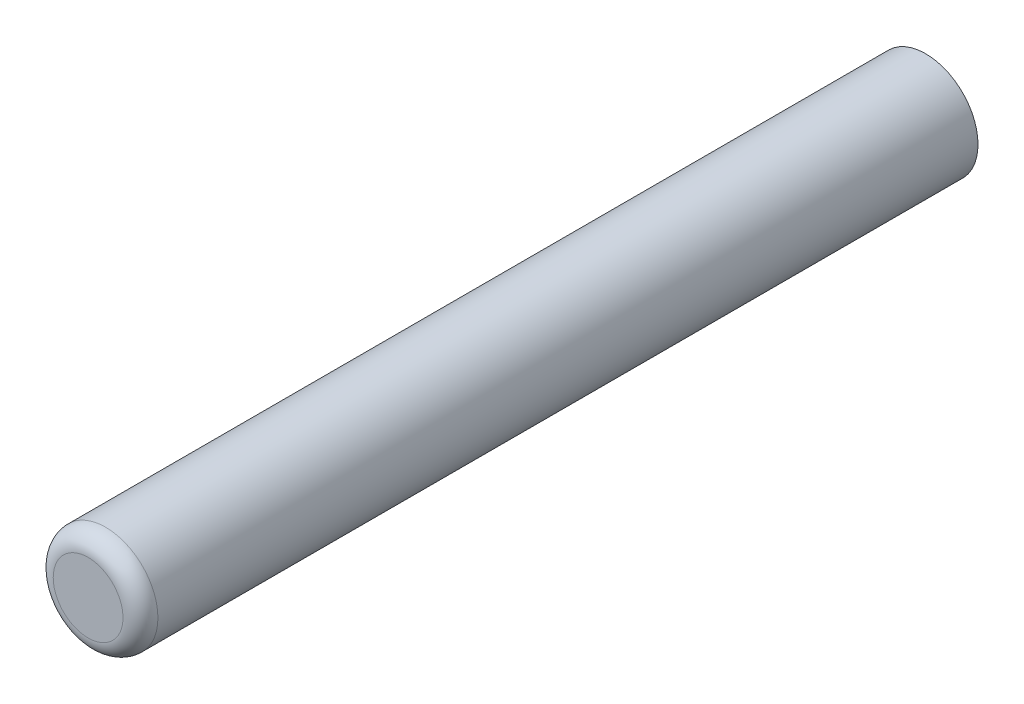
ISO-10303-21;
HEADER;
FILE_DESCRIPTION(('STEP AP214'),'2;1');
FILE_NAME('part.step','',(''),(''),'','','');
FILE_SCHEMA(('AUTOMOTIVE_DESIGN { 1 0 10303 214 1 1 1 1 }'));
ENDSEC;
DATA;
#1=APPLICATION_CONTEXT('core data for automotive mechanical design processes');
#2=APPLICATION_PROTOCOL_DEFINITION('international standard','automotive_design',2000,#1);
#3=PRODUCT_CONTEXT('',#1,'mechanical');
#4=PRODUCT('Part','Part','',(#3));
#5=PRODUCT_RELATED_PRODUCT_CATEGORY('part','',(#4));
#6=PRODUCT_DEFINITION_FORMATION('','',#4);
#7=PRODUCT_DEFINITION_CONTEXT('part definition',#1,'design');
#8=PRODUCT_DEFINITION('design','',#6,#7);
#9=PRODUCT_DEFINITION_SHAPE('','',#8);
#10=(LENGTH_UNIT() NAMED_UNIT(*) SI_UNIT(.MILLI.,.METRE.));
#11=(NAMED_UNIT(*) PLANE_ANGLE_UNIT() SI_UNIT($,.RADIAN.));
#12=(NAMED_UNIT(*) SI_UNIT($,.STERADIAN.) SOLID_ANGLE_UNIT());
#13=UNCERTAINTY_MEASURE_WITH_UNIT(LENGTH_MEASURE(1.E-05),#10,'distance_accuracy_value','');
#14=(GEOMETRIC_REPRESENTATION_CONTEXT(3) GLOBAL_UNCERTAINTY_ASSIGNED_CONTEXT((#13)) GLOBAL_UNIT_ASSIGNED_CONTEXT((#10,
#11,#12)) REPRESENTATION_CONTEXT('',''));
#15=CARTESIAN_POINT('',(0.,0.,0.));
#16=DIRECTION('',(0.,0.,1.));
#17=DIRECTION('',(1.,0.,0.));
#18=AXIS2_PLACEMENT_3D('',#15,#16,#17);
#19=CARTESIAN_POINT('',(0.,0.,0.));
#20=DIRECTION('',(0.,0.,-1.));
#21=DIRECTION('',(-1.,0.,0.));
#22=AXIS2_PLACEMENT_3D('',#19,#20,#21);
#23=PLANE('',#22);
#24=CARTESIAN_POINT('',(0.,0.,0.));
#25=DIRECTION('',(0.,0.,-1.));
#26=DIRECTION('',(-1.,0.,0.));
#27=AXIS2_PLACEMENT_3D('',#24,#25,#26);
#28=CIRCLE('',#27,3.175);
#29=CARTESIAN_POINT('',(-3.175,0.,0.));
#30=VERTEX_POINT('',#29);
#31=EDGE_CURVE('E52',#30,#30,#28,.F.);
#32=ORIENTED_EDGE('',*,*,#31,.T.);
#33=EDGE_LOOP('',(#32));
#34=FACE_BOUND('',#33,.T.);
#35=ADVANCED_FACE('F45',(#34),#23,.F.);
#36=CARTESIAN_POINT('',(0.,0.,0.));
#37=DIRECTION('',(0.,0.,1.));
#38=DIRECTION('',(1.,0.,0.));
#39=AXIS2_PLACEMENT_3D('',#36,#37,#38);
#40=CYLINDRICAL_SURFACE('',#39,4.7625);
#41=CARTESIAN_POINT('',(0.,0.,-1.5875));
#42=DIRECTION('',(0.,0.,-1.));
#43=DIRECTION('',(-1.,0.,0.));
#44=AXIS2_PLACEMENT_3D('',#41,#42,#43);
#45=CIRCLE('',#44,4.7625);
#46=CARTESIAN_POINT('',(-4.7625,0.,-1.5875));
#47=VERTEX_POINT('',#46);
#48=EDGE_CURVE('E10',#47,#47,#45,.T.);
#49=ORIENTED_EDGE('',*,*,#48,.T.);
#50=EDGE_LOOP('',(#49));
#51=FACE_BOUND('',#50,.T.);
#52=CARTESIAN_POINT('',(0.,0.,-76.2));
#53=DIRECTION('',(0.,0.,1.));
#54=DIRECTION('',(1.,0.,0.));
#55=AXIS2_PLACEMENT_3D('',#52,#53,#54);
#56=CIRCLE('',#55,4.7625);
#57=CARTESIAN_POINT('',(4.7625,0.,-76.2));
#58=VERTEX_POINT('',#57);
#59=EDGE_CURVE('E56',#58,#58,#56,.T.);
#60=ORIENTED_EDGE('',*,*,#59,.T.);
#61=EDGE_LOOP('',(#60));
#62=FACE_BOUND('',#61,.T.);
#63=ADVANCED_FACE('F63',(#51,#62),#40,.T.);
#64=CARTESIAN_POINT('',(0.,4.7625,-76.2));
#65=DIRECTION('',(0.,0.,1.));
#66=DIRECTION('',(1.,0.,0.));
#67=AXIS2_PLACEMENT_3D('',#64,#65,#66);
#68=PLANE('',#67);
#69=ORIENTED_EDGE('',*,*,#59,.F.);
#70=EDGE_LOOP('',(#69));
#71=FACE_BOUND('',#70,.T.);
#72=ADVANCED_FACE('F65',(#71),#68,.F.);
#73=CARTESIAN_POINT('',(0.,0.,-1.5875));
#74=DIRECTION('',(0.,0.,-1.));
#75=DIRECTION('',(-1.,0.,0.));
#76=AXIS2_PLACEMENT_3D('',#73,#74,#75);
#77=TOROIDAL_SURFACE('',#76,3.175,1.5875);
#78=ORIENTED_EDGE('',*,*,#48,.F.);
#79=EDGE_LOOP('',(#78));
#80=FACE_BOUND('',#79,.T.);
#81=ORIENTED_EDGE('',*,*,#31,.F.);
#82=EDGE_LOOP('',(#81));
#83=FACE_BOUND('',#82,.T.);
#84=ADVANCED_FACE('F47',(#80,#83),#77,.T.);
#85=CLOSED_SHELL('',(#35,#63,#72,#84));
#86=MANIFOLD_SOLID_BREP('B2',#85);
#87=ADVANCED_BREP_SHAPE_REPRESENTATION('',(#18,#86),#14);
#88=SHAPE_DEFINITION_REPRESENTATION(#9,#87);
ENDSEC;
END-ISO-10303-21;
